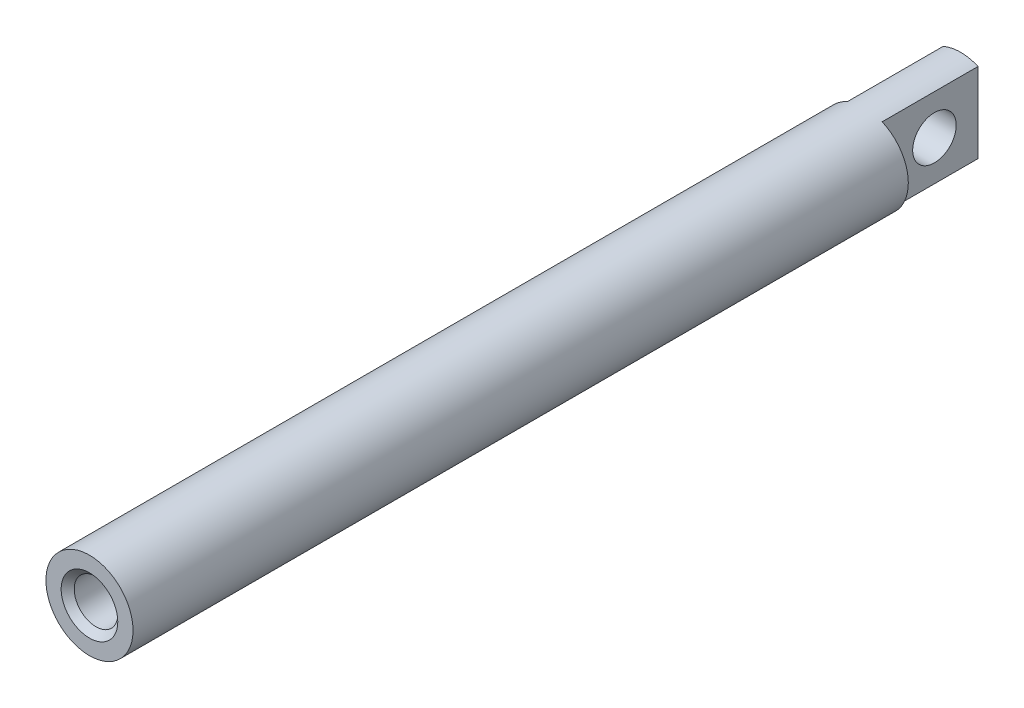
ISO-10303-21;
HEADER;
FILE_DESCRIPTION(('STEP AP214'),'2;1');
FILE_NAME('part.step','',(''),(''),'','','');
FILE_SCHEMA(('AUTOMOTIVE_DESIGN { 1 0 10303 214 1 1 1 1 }'));
ENDSEC;
DATA;
#1=APPLICATION_CONTEXT('core data for automotive mechanical design processes');
#2=APPLICATION_PROTOCOL_DEFINITION('international standard','automotive_design',2000,#1);
#3=PRODUCT_CONTEXT('',#1,'mechanical');
#4=PRODUCT('Part','Part','',(#3));
#5=PRODUCT_RELATED_PRODUCT_CATEGORY('part','',(#4));
#6=PRODUCT_DEFINITION_FORMATION('','',#4);
#7=PRODUCT_DEFINITION_CONTEXT('part definition',#1,'design');
#8=PRODUCT_DEFINITION('design','',#6,#7);
#9=PRODUCT_DEFINITION_SHAPE('','',#8);
#10=(LENGTH_UNIT() NAMED_UNIT(*) SI_UNIT(.MILLI.,.METRE.));
#11=(NAMED_UNIT(*) PLANE_ANGLE_UNIT() SI_UNIT($,.RADIAN.));
#12=(NAMED_UNIT(*) SI_UNIT($,.STERADIAN.) SOLID_ANGLE_UNIT());
#13=UNCERTAINTY_MEASURE_WITH_UNIT(LENGTH_MEASURE(1.E-05),#10,'distance_accuracy_value','');
#14=(GEOMETRIC_REPRESENTATION_CONTEXT(3) GLOBAL_UNCERTAINTY_ASSIGNED_CONTEXT((#13)) GLOBAL_UNIT_ASSIGNED_CONTEXT((#10,
#11,#12)) REPRESENTATION_CONTEXT('',''));
#15=CARTESIAN_POINT('',(0.,0.,0.));
#16=DIRECTION('',(0.,0.,1.));
#17=DIRECTION('',(1.,0.,0.));
#18=AXIS2_PLACEMENT_3D('',#15,#16,#17);
#19=CARTESIAN_POINT('',(0.,0.,-100.));
#20=DIRECTION('',(0.,0.,1.));
#21=DIRECTION('',(1.,0.,0.));
#22=AXIS2_PLACEMENT_3D('',#19,#20,#21);
#23=CYLINDRICAL_SURFACE('',#22,5.);
#24=CARTESIAN_POINT('',(0.,0.,0.));
#25=DIRECTION('',(0.,0.,1.));
#26=DIRECTION('',(1.,0.,0.));
#27=AXIS2_PLACEMENT_3D('',#24,#25,#26);
#28=CIRCLE('',#27,5.);
#29=CARTESIAN_POINT('',(5.,0.,0.));
#30=VERTEX_POINT('',#29);
#31=EDGE_CURVE('E48',#30,#30,#28,.T.);
#32=ORIENTED_EDGE('',*,*,#31,.F.);
#33=EDGE_LOOP('',(#32));
#34=FACE_BOUND('',#33,.T.);
#35=CARTESIAN_POINT('',(0.,0.,-89.));
#36=DIRECTION('',(0.,0.,-1.));
#37=DIRECTION('',(-1.,0.,0.));
#38=AXIS2_PLACEMENT_3D('',#35,#36,#37);
#39=CIRCLE('',#38,5.);
#40=CARTESIAN_POINT('',(2.,4.58257569495584,-89.));
#41=VERTEX_POINT('',#40);
#42=CARTESIAN_POINT('',(2.,-4.58257569495584,-89.));
#43=VERTEX_POINT('',#42);
#44=EDGE_CURVE('E113',#41,#43,#39,.T.);
#45=ORIENTED_EDGE('',*,*,#44,.F.);
#46=DIRECTION('',(0.,0.,1.));
#47=VECTOR('',#46,1.);
#48=CARTESIAN_POINT('',(2.,4.58257569495584,-100.));
#49=LINE('',#48,#47);
#50=CARTESIAN_POINT('',(2.,4.58257569495584,-100.));
#51=VERTEX_POINT('',#50);
#52=EDGE_CURVE('E115',#51,#41,#49,.T.);
#53=ORIENTED_EDGE('',*,*,#52,.F.);
#54=CARTESIAN_POINT('',(0.,0.,-100.));
#55=DIRECTION('',(0.,0.,1.));
#56=DIRECTION('',(1.,0.,0.));
#57=AXIS2_PLACEMENT_3D('',#54,#55,#56);
#58=CIRCLE('',#57,5.);
#59=CARTESIAN_POINT('',(-2.,4.58257569495584,-100.));
#60=VERTEX_POINT('',#59);
#61=EDGE_CURVE('E53',#51,#60,#58,.T.);
#62=ORIENTED_EDGE('',*,*,#61,.T.);
#63=DIRECTION('',(0.,0.,1.));
#64=VECTOR('',#63,1.);
#65=CARTESIAN_POINT('',(-2.,4.58257569495584,-100.));
#66=LINE('',#65,#64);
#67=CARTESIAN_POINT('',(-2.,4.58257569495584,-89.));
#68=VERTEX_POINT('',#67);
#69=EDGE_CURVE('E128',#68,#60,#66,.F.);
#70=ORIENTED_EDGE('',*,*,#69,.F.);
#71=CARTESIAN_POINT('',(0.,0.,-89.));
#72=DIRECTION('',(0.,0.,-1.));
#73=DIRECTION('',(-1.,0.,0.));
#74=AXIS2_PLACEMENT_3D('',#71,#72,#73);
#75=CIRCLE('',#74,5.);
#76=CARTESIAN_POINT('',(-2.,-4.58257569495584,-89.));
#77=VERTEX_POINT('',#76);
#78=EDGE_CURVE('E125',#77,#68,#75,.T.);
#79=ORIENTED_EDGE('',*,*,#78,.F.);
#80=DIRECTION('',(0.,0.,1.));
#81=VECTOR('',#80,1.);
#82=CARTESIAN_POINT('',(-2.,-4.58257569495584,-100.));
#83=LINE('',#82,#81);
#84=CARTESIAN_POINT('',(-2.,-4.58257569495584,-100.));
#85=VERTEX_POINT('',#84);
#86=EDGE_CURVE('E122',#77,#85,#83,.F.);
#87=ORIENTED_EDGE('',*,*,#86,.T.);
#88=CARTESIAN_POINT('',(2.,-4.58257569495584,-100.));
#89=VERTEX_POINT('',#88);
#90=EDGE_CURVE('E11',#85,#89,#58,.T.);
#91=ORIENTED_EDGE('',*,*,#90,.T.);
#92=DIRECTION('',(0.,0.,1.));
#93=VECTOR('',#92,1.);
#94=CARTESIAN_POINT('',(2.,-4.58257569495584,-100.));
#95=LINE('',#94,#93);
#96=EDGE_CURVE('E60',#89,#43,#95,.T.);
#97=ORIENTED_EDGE('',*,*,#96,.T.);
#98=EDGE_LOOP('',(#45,#53,#62,#70,#79,#87,#91,#97));
#99=FACE_BOUND('',#98,.T.);
#100=ADVANCED_FACE('F45',(#34,#99),#23,.T.);
#101=CARTESIAN_POINT('',(0.,0.,-100.));
#102=DIRECTION('',(0.,0.,1.));
#103=DIRECTION('',(1.,0.,0.));
#104=AXIS2_PLACEMENT_3D('',#101,#102,#103);
#105=PLANE('',#104);
#106=DIRECTION('',(0.,-1.,0.));
#107=VECTOR('',#106,1.);
#108=CARTESIAN_POINT('',(2.,5.001,-100.));
#109=LINE('',#108,#107);
#110=EDGE_CURVE('E120',#51,#89,#109,.T.);
#111=ORIENTED_EDGE('',*,*,#110,.T.);
#112=ORIENTED_EDGE('',*,*,#90,.F.);
#113=DIRECTION('',(0.,-1.,0.));
#114=VECTOR('',#113,1.);
#115=CARTESIAN_POINT('',(-2.,5.001,-100.));
#116=LINE('',#115,#114);
#117=EDGE_CURVE('E130',#60,#85,#116,.T.);
#118=ORIENTED_EDGE('',*,*,#117,.F.);
#119=ORIENTED_EDGE('',*,*,#61,.F.);
#120=EDGE_LOOP('',(#111,#112,#118,#119));
#121=FACE_BOUND('',#120,.T.);
#122=ADVANCED_FACE('F141',(#121),#105,.F.);
#123=CARTESIAN_POINT('',(0.,0.,0.));
#124=DIRECTION('',(0.,0.,1.));
#125=DIRECTION('',(1.,0.,0.));
#126=AXIS2_PLACEMENT_3D('',#123,#124,#125);
#127=PLANE('',#126);
#128=CARTESIAN_POINT('',(0.,0.,0.));
#129=DIRECTION('',(0.,0.,1.));
#130=DIRECTION('',(1.,0.,0.));
#131=AXIS2_PLACEMENT_3D('',#128,#129,#130);
#132=CIRCLE('',#131,3.25);
#133=CARTESIAN_POINT('',(3.25,0.,0.));
#134=VERTEX_POINT('',#133);
#135=EDGE_CURVE('E106',#134,#134,#132,.T.);
#136=ORIENTED_EDGE('',*,*,#135,.F.);
#137=EDGE_LOOP('',(#136));
#138=FACE_BOUND('',#137,.T.);
#139=ORIENTED_EDGE('',*,*,#31,.T.);
#140=EDGE_LOOP('',(#139));
#141=FACE_BOUND('',#140,.T.);
#142=ADVANCED_FACE('F138',(#138,#141),#127,.T.);
#143=CARTESIAN_POINT('',(-5.,5.001,-89.));
#144=DIRECTION('',(0.,0.,-1.));
#145=DIRECTION('',(-1.,0.,0.));
#146=AXIS2_PLACEMENT_3D('',#143,#144,#145);
#147=PLANE('',#146);
#148=ORIENTED_EDGE('',*,*,#78,.T.);
#149=DIRECTION('',(0.,-1.,0.));
#150=VECTOR('',#149,1.);
#151=CARTESIAN_POINT('',(-2.,5.001,-89.));
#152=LINE('',#151,#150);
#153=EDGE_CURVE('E132',#68,#77,#152,.T.);
#154=ORIENTED_EDGE('',*,*,#153,.T.);
#155=EDGE_LOOP('',(#148,#154));
#156=FACE_BOUND('',#155,.T.);
#157=ADVANCED_FACE('F152',(#156),#147,.T.);
#158=CARTESIAN_POINT('',(-2.,5.001,-100.));
#159=DIRECTION('',(-1.,0.,0.));
#160=DIRECTION('',(0.,0.,1.));
#161=AXIS2_PLACEMENT_3D('',#158,#159,#160);
#162=PLANE('',#161);
#163=CARTESIAN_POINT('',(-2.,0.,-95.));
#164=DIRECTION('',(-1.,0.,0.));
#165=DIRECTION('',(0.,0.,1.));
#166=AXIS2_PLACEMENT_3D('',#163,#164,#165);
#167=CIRCLE('',#166,2.5);
#168=CARTESIAN_POINT('',(-2.,0.,-92.5));
#169=VERTEX_POINT('',#168);
#170=EDGE_CURVE('E99',#169,#169,#167,.F.);
#171=ORIENTED_EDGE('',*,*,#170,.T.);
#172=EDGE_LOOP('',(#171));
#173=FACE_BOUND('',#172,.T.);
#174=ORIENTED_EDGE('',*,*,#69,.T.);
#175=ORIENTED_EDGE('',*,*,#117,.T.);
#176=ORIENTED_EDGE('',*,*,#86,.F.);
#177=ORIENTED_EDGE('',*,*,#153,.F.);
#178=EDGE_LOOP('',(#174,#175,#176,#177));
#179=FACE_BOUND('',#178,.T.);
#180=ADVANCED_FACE('F151',(#173,#179),#162,.T.);
#181=CARTESIAN_POINT('',(5.,5.001,-89.));
#182=DIRECTION('',(0.,0.,-1.));
#183=DIRECTION('',(-1.,0.,0.));
#184=AXIS2_PLACEMENT_3D('',#181,#182,#183);
#185=PLANE('',#184);
#186=ORIENTED_EDGE('',*,*,#44,.T.);
#187=DIRECTION('',(0.,-1.,0.));
#188=VECTOR('',#187,1.);
#189=CARTESIAN_POINT('',(2.,5.001,-89.));
#190=LINE('',#189,#188);
#191=EDGE_CURVE('E118',#41,#43,#190,.T.);
#192=ORIENTED_EDGE('',*,*,#191,.F.);
#193=EDGE_LOOP('',(#186,#192));
#194=FACE_BOUND('',#193,.T.);
#195=ADVANCED_FACE('F144',(#194),#185,.T.);
#196=CARTESIAN_POINT('',(2.,5.001,-100.));
#197=DIRECTION('',(1.,0.,0.));
#198=DIRECTION('',(0.,0.,-1.));
#199=AXIS2_PLACEMENT_3D('',#196,#197,#198);
#200=PLANE('',#199);
#201=CARTESIAN_POINT('',(2.,0.,-95.));
#202=DIRECTION('',(1.,0.,0.));
#203=DIRECTION('',(0.,0.,-1.));
#204=AXIS2_PLACEMENT_3D('',#201,#202,#203);
#205=CIRCLE('',#204,2.5);
#206=CARTESIAN_POINT('',(2.,0.,-97.5));
#207=VERTEX_POINT('',#206);
#208=EDGE_CURVE('E103',#207,#207,#205,.T.);
#209=ORIENTED_EDGE('',*,*,#208,.F.);
#210=EDGE_LOOP('',(#209));
#211=FACE_BOUND('',#210,.T.);
#212=ORIENTED_EDGE('',*,*,#52,.T.);
#213=ORIENTED_EDGE('',*,*,#191,.T.);
#214=ORIENTED_EDGE('',*,*,#96,.F.);
#215=ORIENTED_EDGE('',*,*,#110,.F.);
#216=EDGE_LOOP('',(#212,#213,#214,#215));
#217=FACE_BOUND('',#216,.T.);
#218=ADVANCED_FACE('F145',(#211,#217),#200,.T.);
#219=CARTESIAN_POINT('',(-5.00100000000002,0.,-95.));
#220=DIRECTION('',(1.,0.,0.));
#221=DIRECTION('',(0.,0.,-1.));
#222=AXIS2_PLACEMENT_3D('',#219,#220,#221);
#223=CYLINDRICAL_SURFACE('',#222,2.5);
#224=ORIENTED_EDGE('',*,*,#170,.F.);
#225=EDGE_LOOP('',(#224));
#226=FACE_BOUND('',#225,.T.);
#227=ORIENTED_EDGE('',*,*,#208,.T.);
#228=EDGE_LOOP('',(#227));
#229=FACE_BOUND('',#228,.T.);
#230=ADVANCED_FACE('F93',(#226,#229),#223,.F.);
#231=CARTESIAN_POINT('',(0.,0.,-17.));
#232=DIRECTION('',(0.,0.,1.));
#233=DIRECTION('',(1.,0.,0.));
#234=AXIS2_PLACEMENT_3D('',#231,#232,#233);
#235=CONICAL_SURFACE('',#234,2.49999999999999,1.02974425867665);
#236=CARTESIAN_POINT('',(0.,0.,-18.5021515475689));
#237=VERTEX_POINT('',#236);
#238=VERTEX_LOOP('',#237);
#239=FACE_BOUND('',#238,.T.);
#240=CARTESIAN_POINT('',(0.,0.,-17.));
#241=DIRECTION('',(0.,0.,1.));
#242=DIRECTION('',(1.,0.,0.));
#243=AXIS2_PLACEMENT_3D('',#240,#241,#242);
#244=CIRCLE('',#243,2.49999999999999);
#245=CARTESIAN_POINT('',(2.49999999999999,0.,-17.));
#246=VERTEX_POINT('',#245);
#247=EDGE_CURVE('E97',#246,#246,#244,.T.);
#248=ORIENTED_EDGE('',*,*,#247,.T.);
#249=EDGE_LOOP('',(#248));
#250=FACE_BOUND('',#249,.T.);
#251=ADVANCED_FACE('F89',(#239,#250),#235,.F.);
#252=CARTESIAN_POINT('',(0.,0.,0.));
#253=DIRECTION('',(0.,0.,1.));
#254=DIRECTION('',(1.,0.,0.));
#255=AXIS2_PLACEMENT_3D('',#252,#253,#254);
#256=CYLINDRICAL_SURFACE('',#255,2.49999999999999);
#257=ORIENTED_EDGE('',*,*,#247,.F.);
#258=EDGE_LOOP('',(#257));
#259=FACE_BOUND('',#258,.T.);
#260=CARTESIAN_POINT('',(0.,0.,-0.750000000000001));
#261=DIRECTION('',(0.,0.,1.));
#262=DIRECTION('',(1.,0.,0.));
#263=AXIS2_PLACEMENT_3D('',#260,#261,#262);
#264=CIRCLE('',#263,2.5);
#265=CARTESIAN_POINT('',(2.5,0.,-0.750000000000001));
#266=VERTEX_POINT('',#265);
#267=EDGE_CURVE('E100',#266,#266,#264,.T.);
#268=ORIENTED_EDGE('',*,*,#267,.T.);
#269=EDGE_LOOP('',(#268));
#270=FACE_BOUND('',#269,.T.);
#271=ADVANCED_FACE('F92',(#259,#270),#256,.F.);
#272=CARTESIAN_POINT('',(0.,0.,0.));
#273=DIRECTION('',(0.,0.,1.));
#274=DIRECTION('',(1.,0.,0.));
#275=AXIS2_PLACEMENT_3D('',#272,#273,#274);
#276=CONICAL_SURFACE('',#275,3.25,0.785398163397449);
#277=ORIENTED_EDGE('',*,*,#267,.F.);
#278=EDGE_LOOP('',(#277));
#279=FACE_BOUND('',#278,.T.);
#280=ORIENTED_EDGE('',*,*,#135,.T.);
#281=EDGE_LOOP('',(#280));
#282=FACE_BOUND('',#281,.T.);
#283=ADVANCED_FACE('F224',(#279,#282),#276,.F.);
#284=CLOSED_SHELL('',(#100,#122,#142,#157,#180,#195,#218,#230,#251,#271,#283));
#285=MANIFOLD_SOLID_BREP('B2',#284);
#286=ADVANCED_BREP_SHAPE_REPRESENTATION('',(#18,#285),#14);
#287=SHAPE_DEFINITION_REPRESENTATION(#9,#286);
ENDSEC;
END-ISO-10303-21;
